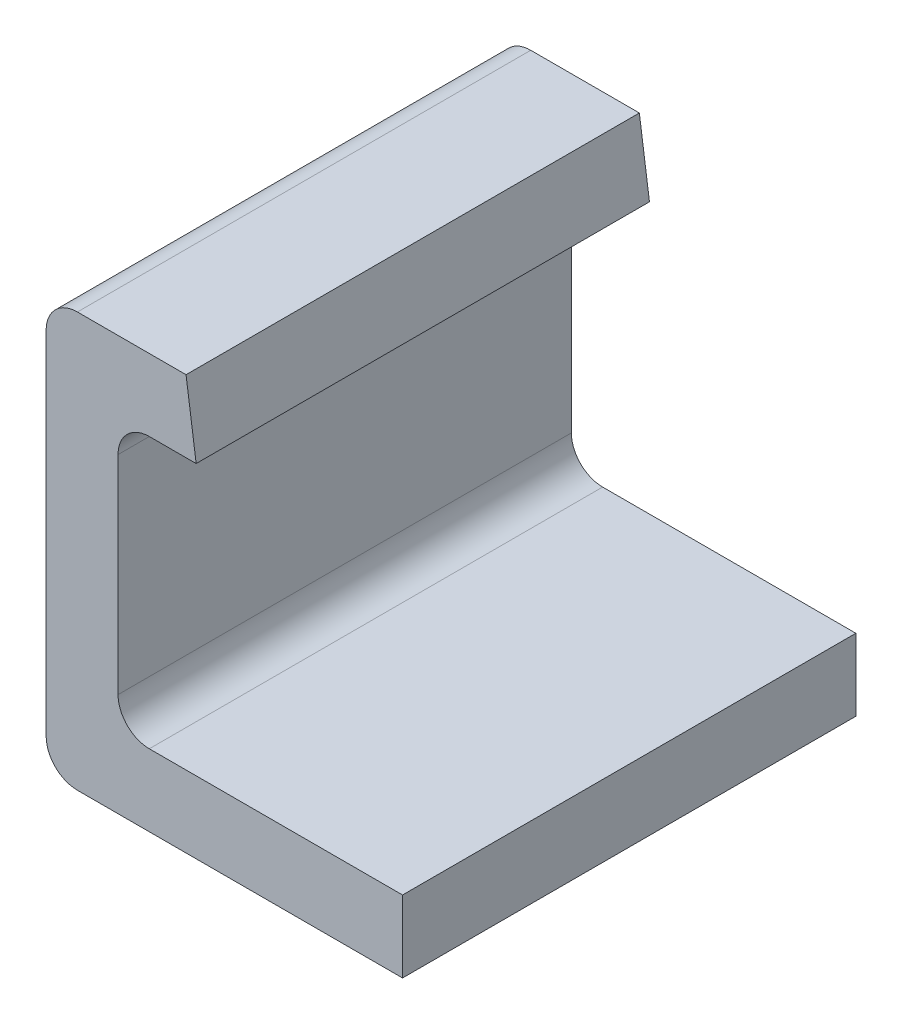
ISO-10303-21;
HEADER;
FILE_DESCRIPTION(('STEP AP214'),'2;1');
FILE_NAME('part.step','',(''),(''),'','','');
FILE_SCHEMA(('AUTOMOTIVE_DESIGN { 1 0 10303 214 1 1 1 1 }'));
ENDSEC;
DATA;
#1=APPLICATION_CONTEXT('core data for automotive mechanical design processes');
#2=APPLICATION_PROTOCOL_DEFINITION('international standard','automotive_design',2000,#1);
#3=PRODUCT_CONTEXT('',#1,'mechanical');
#4=PRODUCT('Part','Part','',(#3));
#5=PRODUCT_RELATED_PRODUCT_CATEGORY('part','',(#4));
#6=PRODUCT_DEFINITION_FORMATION('','',#4);
#7=PRODUCT_DEFINITION_CONTEXT('part definition',#1,'design');
#8=PRODUCT_DEFINITION('design','',#6,#7);
#9=PRODUCT_DEFINITION_SHAPE('','',#8);
#10=(LENGTH_UNIT() NAMED_UNIT(*) SI_UNIT(.MILLI.,.METRE.));
#11=(NAMED_UNIT(*) PLANE_ANGLE_UNIT() SI_UNIT($,.RADIAN.));
#12=(NAMED_UNIT(*) SI_UNIT($,.STERADIAN.) SOLID_ANGLE_UNIT());
#13=UNCERTAINTY_MEASURE_WITH_UNIT(LENGTH_MEASURE(1.E-05),#10,'distance_accuracy_value','');
#14=(GEOMETRIC_REPRESENTATION_CONTEXT(3) GLOBAL_UNCERTAINTY_ASSIGNED_CONTEXT((#13)) GLOBAL_UNIT_ASSIGNED_CONTEXT((#10,
#11,#12)) REPRESENTATION_CONTEXT('',''));
#15=CARTESIAN_POINT('',(0.,0.,0.));
#16=DIRECTION('',(0.,0.,1.));
#17=DIRECTION('',(1.,0.,0.));
#18=AXIS2_PLACEMENT_3D('',#15,#16,#17);
#19=CARTESIAN_POINT('',(0.10625,0.3325,0.));
#20=DIRECTION('',(0.,0.,-1.));
#21=DIRECTION('',(-1.,0.,0.));
#22=AXIS2_PLACEMENT_3D('',#19,#20,#21);
#23=CYLINDRICAL_SURFACE('',#22,0.1);
#24=DIRECTION('',(0.,0.,-1.));
#25=VECTOR('',#24,1.);
#26=CARTESIAN_POINT('',(0.00625,0.3325,0.));
#27=LINE('',#26,#25);
#28=CARTESIAN_POINT('',(0.00625,0.3325,0.));
#29=VERTEX_POINT('',#28);
#30=CARTESIAN_POINT('',(0.00625,0.3325,1.45));
#31=VERTEX_POINT('',#30);
#32=EDGE_CURVE('E96',#29,#31,#27,.F.);
#33=ORIENTED_EDGE('',*,*,#32,.F.);
#34=CARTESIAN_POINT('',(0.10625,0.3325,0.));
#35=DIRECTION('',(0.,0.,-1.));
#36=DIRECTION('',(-1.,0.,0.));
#37=AXIS2_PLACEMENT_3D('',#34,#35,#36);
#38=CIRCLE('',#37,0.1);
#39=CARTESIAN_POINT('',(0.10625,0.4325,0.));
#40=VERTEX_POINT('',#39);
#41=EDGE_CURVE('E20',#40,#29,#38,.F.);
#42=ORIENTED_EDGE('',*,*,#41,.F.);
#43=DIRECTION('',(0.,0.,-1.));
#44=VECTOR('',#43,1.);
#45=CARTESIAN_POINT('',(0.10625,0.4325,0.));
#46=LINE('',#45,#44);
#47=CARTESIAN_POINT('',(0.10625,0.4325,1.45));
#48=VERTEX_POINT('',#47);
#49=EDGE_CURVE('E120',#48,#40,#46,.T.);
#50=ORIENTED_EDGE('',*,*,#49,.F.);
#51=CARTESIAN_POINT('',(0.10625,0.3325,1.45));
#52=DIRECTION('',(0.,0.,-1.));
#53=DIRECTION('',(-1.,0.,0.));
#54=AXIS2_PLACEMENT_3D('',#51,#52,#53);
#55=CIRCLE('',#54,0.1);
#56=EDGE_CURVE('E94',#31,#48,#55,.T.);
#57=ORIENTED_EDGE('',*,*,#56,.F.);
#58=EDGE_LOOP('',(#33,#42,#50,#57));
#59=FACE_BOUND('',#58,.T.);
#60=ADVANCED_FACE('F17',(#59),#23,.F.);
#61=CARTESIAN_POINT('',(-0.22375,0.4325,0.));
#62=DIRECTION('',(0.,-1.,0.));
#63=DIRECTION('',(0.,0.,-1.));
#64=AXIS2_PLACEMENT_3D('',#61,#62,#63);
#65=PLANE('',#64);
#66=DIRECTION('',(0.,0.,1.));
#67=VECTOR('',#66,1.);
#68=CARTESIAN_POINT('',(0.25607439198153,0.432499999999934,1.45));
#69=LINE('',#68,#67);
#70=CARTESIAN_POINT('',(0.25607439198153,0.432499999999956,1.45));
#71=VERTEX_POINT('',#70);
#72=CARTESIAN_POINT('',(0.256074391981687,0.432499999999956,0.));
#73=VERTEX_POINT('',#72);
#74=EDGE_CURVE('E109',#71,#73,#69,.F.);
#75=ORIENTED_EDGE('',*,*,#74,.F.);
#76=DIRECTION('',(1.,0.,0.));
#77=VECTOR('',#76,1.);
#78=CARTESIAN_POINT('',(-0.22375,0.4325,1.45));
#79=LINE('',#78,#77);
#80=EDGE_CURVE('E100',#71,#48,#79,.F.);
#81=ORIENTED_EDGE('',*,*,#80,.T.);
#82=ORIENTED_EDGE('',*,*,#49,.T.);
#83=DIRECTION('',(1.,0.,0.));
#84=VECTOR('',#83,1.);
#85=CARTESIAN_POINT('',(-0.22375,0.4325,0.));
#86=LINE('',#85,#84);
#87=EDGE_CURVE('E92',#40,#73,#86,.T.);
#88=ORIENTED_EDGE('',*,*,#87,.T.);
#89=EDGE_LOOP('',(#75,#81,#82,#88));
#90=FACE_BOUND('',#89,.T.);
#91=ADVANCED_FACE('F155',(#90),#65,.T.);
#92=CARTESIAN_POINT('',(0.00625,-0.6625,0.));
#93=DIRECTION('',(1.,0.,0.));
#94=DIRECTION('',(0.,0.,-1.));
#95=AXIS2_PLACEMENT_3D('',#92,#93,#94);
#96=PLANE('',#95);
#97=DIRECTION('',(0.,0.,-1.));
#98=VECTOR('',#97,1.);
#99=CARTESIAN_POINT('',(0.00624999999999998,-0.3325,0.));
#100=LINE('',#99,#98);
#101=CARTESIAN_POINT('',(0.00624999999999999,-0.3325,1.45));
#102=VERTEX_POINT('',#101);
#103=CARTESIAN_POINT('',(0.00624999999999999,-0.3325,0.));
#104=VERTEX_POINT('',#103);
#105=EDGE_CURVE('E104',#102,#104,#100,.T.);
#106=ORIENTED_EDGE('',*,*,#105,.T.);
#107=DIRECTION('',(0.,1.,0.));
#108=VECTOR('',#107,1.);
#109=CARTESIAN_POINT('',(0.00625,-0.6625,0.));
#110=LINE('',#109,#108);
#111=EDGE_CURVE('E88',#104,#29,#110,.T.);
#112=ORIENTED_EDGE('',*,*,#111,.T.);
#113=ORIENTED_EDGE('',*,*,#32,.T.);
#114=DIRECTION('',(0.,1.,0.));
#115=VECTOR('',#114,1.);
#116=CARTESIAN_POINT('',(0.00625,-0.6625,1.45));
#117=LINE('',#116,#115);
#118=EDGE_CURVE('E99',#31,#102,#117,.F.);
#119=ORIENTED_EDGE('',*,*,#118,.T.);
#120=EDGE_LOOP('',(#106,#112,#113,#119));
#121=FACE_BOUND('',#120,.T.);
#122=ADVANCED_FACE('F102',(#121),#96,.T.);
#123=CARTESIAN_POINT('',(0.22375,0.6625,1.45));
#124=DIRECTION('',(0.990268068741588,0.139173100959942,0.));
#125=DIRECTION('',(-0.139173100959942,0.990268068741588,0.));
#126=AXIS2_PLACEMENT_3D('',#123,#124,#125);
#127=PLANE('',#126);
#128=DIRECTION('',(-0.139173100959942,0.990268068741588,0.));
#129=VECTOR('',#128,1.);
#130=CARTESIAN_POINT('',(0.22375,0.6625,0.));
#131=LINE('',#130,#129);
#132=CARTESIAN_POINT('',(0.22375,0.6625,0.));
#133=VERTEX_POINT('',#132);
#134=EDGE_CURVE('E116',#73,#133,#131,.T.);
#135=ORIENTED_EDGE('',*,*,#134,.T.);
#136=DIRECTION('',(0.,0.,1.));
#137=VECTOR('',#136,1.);
#138=CARTESIAN_POINT('',(0.22375,0.6625,0.));
#139=LINE('',#138,#137);
#140=CARTESIAN_POINT('',(0.22375,0.6625,1.45));
#141=VERTEX_POINT('',#140);
#142=EDGE_CURVE('E162',#141,#133,#139,.F.);
#143=ORIENTED_EDGE('',*,*,#142,.F.);
#144=DIRECTION('',(-0.139173100959942,0.990268068741588,0.));
#145=VECTOR('',#144,1.);
#146=CARTESIAN_POINT('',(0.22375,0.6625,1.45));
#147=LINE('',#146,#145);
#148=EDGE_CURVE('E106',#141,#71,#147,.F.);
#149=ORIENTED_EDGE('',*,*,#148,.T.);
#150=ORIENTED_EDGE('',*,*,#74,.T.);
#151=EDGE_LOOP('',(#135,#143,#149,#150));
#152=FACE_BOUND('',#151,.T.);
#153=ADVANCED_FACE('F160',(#152),#127,.T.);
#154=CARTESIAN_POINT('',(0.10625,-0.3325,0.));
#155=DIRECTION('',(0.,0.,-1.));
#156=DIRECTION('',(-1.,0.,0.));
#157=AXIS2_PLACEMENT_3D('',#154,#155,#156);
#158=CYLINDRICAL_SURFACE('',#157,0.1);
#159=DIRECTION('',(0.,0.,1.));
#160=VECTOR('',#159,1.);
#161=CARTESIAN_POINT('',(0.10625,-0.4325,0.));
#162=LINE('',#161,#160);
#163=CARTESIAN_POINT('',(0.10625,-0.4325,0.));
#164=VERTEX_POINT('',#163);
#165=CARTESIAN_POINT('',(0.10625,-0.4325,1.45));
#166=VERTEX_POINT('',#165);
#167=EDGE_CURVE('E200',#164,#166,#162,.T.);
#168=ORIENTED_EDGE('',*,*,#167,.F.);
#169=CARTESIAN_POINT('',(0.10625,-0.3325,0.));
#170=DIRECTION('',(0.,0.,-1.));
#171=DIRECTION('',(-1.,0.,0.));
#172=AXIS2_PLACEMENT_3D('',#169,#170,#171);
#173=CIRCLE('',#172,0.1);
#174=EDGE_CURVE('E148',#104,#164,#173,.F.);
#175=ORIENTED_EDGE('',*,*,#174,.F.);
#176=ORIENTED_EDGE('',*,*,#105,.F.);
#177=CARTESIAN_POINT('',(0.10625,-0.3325,1.45));
#178=DIRECTION('',(0.,0.,-1.));
#179=DIRECTION('',(-1.,0.,0.));
#180=AXIS2_PLACEMENT_3D('',#177,#178,#179);
#181=CIRCLE('',#180,0.1);
#182=EDGE_CURVE('E144',#166,#102,#181,.T.);
#183=ORIENTED_EDGE('',*,*,#182,.F.);
#184=EDGE_LOOP('',(#168,#175,#176,#183));
#185=FACE_BOUND('',#184,.T.);
#186=ADVANCED_FACE('F261',(#185),#158,.F.);
#187=CARTESIAN_POINT('',(0.91625,-0.6625,0.));
#188=DIRECTION('',(1.,0.,0.));
#189=DIRECTION('',(0.,0.,-1.));
#190=AXIS2_PLACEMENT_3D('',#187,#188,#189);
#191=PLANE('',#190);
#192=DIRECTION('',(0.,1.,0.));
#193=VECTOR('',#192,1.);
#194=CARTESIAN_POINT('',(0.91625,-0.6625,1.45));
#195=LINE('',#194,#193);
#196=CARTESIAN_POINT('',(0.91625,-0.4325,1.45));
#197=VERTEX_POINT('',#196);
#198=CARTESIAN_POINT('',(0.91625,-0.6625,1.45));
#199=VERTEX_POINT('',#198);
#200=EDGE_CURVE('E188',#197,#199,#195,.F.);
#201=ORIENTED_EDGE('',*,*,#200,.T.);
#202=DIRECTION('',(0.,0.,-1.));
#203=VECTOR('',#202,1.);
#204=CARTESIAN_POINT('',(0.91625,-0.6625,0.));
#205=LINE('',#204,#203);
#206=CARTESIAN_POINT('',(0.91625,-0.6625,0.));
#207=VERTEX_POINT('',#206);
#208=EDGE_CURVE('E191',#207,#199,#205,.F.);
#209=ORIENTED_EDGE('',*,*,#208,.F.);
#210=DIRECTION('',(0.,1.,0.));
#211=VECTOR('',#210,1.);
#212=CARTESIAN_POINT('',(0.91625,-0.6625,0.));
#213=LINE('',#212,#211);
#214=CARTESIAN_POINT('',(0.91625,-0.4325,0.));
#215=VERTEX_POINT('',#214);
#216=EDGE_CURVE('E147',#207,#215,#213,.T.);
#217=ORIENTED_EDGE('',*,*,#216,.T.);
#218=DIRECTION('',(0.,0.,1.));
#219=VECTOR('',#218,1.);
#220=CARTESIAN_POINT('',(0.91625,-0.4325,0.));
#221=LINE('',#220,#219);
#222=EDGE_CURVE('E193',#197,#215,#221,.F.);
#223=ORIENTED_EDGE('',*,*,#222,.F.);
#224=EDGE_LOOP('',(#201,#209,#217,#223));
#225=FACE_BOUND('',#224,.T.);
#226=ADVANCED_FACE('F190',(#225),#191,.T.);
#227=CARTESIAN_POINT('',(0.22375,0.6625,0.));
#228=DIRECTION('',(0.,1.,0.));
#229=DIRECTION('',(0.,0.,1.));
#230=AXIS2_PLACEMENT_3D('',#227,#228,#229);
#231=PLANE('',#230);
#232=ORIENTED_EDGE('',*,*,#142,.T.);
#233=DIRECTION('',(1.,0.,0.));
#234=VECTOR('',#233,1.);
#235=CARTESIAN_POINT('',(0.22375,0.6625,0.));
#236=LINE('',#235,#234);
#237=CARTESIAN_POINT('',(-0.12375,0.6625,0.));
#238=VERTEX_POINT('',#237);
#239=EDGE_CURVE('E201',#133,#238,#236,.F.);
#240=ORIENTED_EDGE('',*,*,#239,.T.);
#241=DIRECTION('',(0.,0.,1.));
#242=VECTOR('',#241,1.);
#243=CARTESIAN_POINT('',(-0.12375,0.6625,0.));
#244=LINE('',#243,#242);
#245=CARTESIAN_POINT('',(-0.12375,0.6625,1.45));
#246=VERTEX_POINT('',#245);
#247=EDGE_CURVE('E137',#246,#238,#244,.F.);
#248=ORIENTED_EDGE('',*,*,#247,.F.);
#249=DIRECTION('',(1.,0.,0.));
#250=VECTOR('',#249,1.);
#251=CARTESIAN_POINT('',(0.,0.6625,1.45));
#252=LINE('',#251,#250);
#253=EDGE_CURVE('E138',#141,#246,#252,.F.);
#254=ORIENTED_EDGE('',*,*,#253,.F.);
#255=EDGE_LOOP('',(#232,#240,#248,#254));
#256=FACE_BOUND('',#255,.T.);
#257=ADVANCED_FACE('F239',(#256),#231,.T.);
#258=CARTESIAN_POINT('',(-0.22375,-0.6625,0.));
#259=DIRECTION('',(0.,-1.,0.));
#260=DIRECTION('',(0.,0.,-1.));
#261=AXIS2_PLACEMENT_3D('',#258,#259,#260);
#262=PLANE('',#261);
#263=ORIENTED_EDGE('',*,*,#208,.T.);
#264=DIRECTION('',(1.,0.,0.));
#265=VECTOR('',#264,1.);
#266=CARTESIAN_POINT('',(0.,-0.6625,1.45));
#267=LINE('',#266,#265);
#268=CARTESIAN_POINT('',(-0.12375,-0.6625,1.45));
#269=VERTEX_POINT('',#268);
#270=EDGE_CURVE('E142',#269,#199,#267,.T.);
#271=ORIENTED_EDGE('',*,*,#270,.F.);
#272=DIRECTION('',(0.,0.,1.));
#273=VECTOR('',#272,1.);
#274=CARTESIAN_POINT('',(-0.12375,-0.6625,0.));
#275=LINE('',#274,#273);
#276=CARTESIAN_POINT('',(-0.12375,-0.6625,0.));
#277=VERTEX_POINT('',#276);
#278=EDGE_CURVE('E143',#277,#269,#275,.T.);
#279=ORIENTED_EDGE('',*,*,#278,.F.);
#280=DIRECTION('',(1.,0.,0.));
#281=VECTOR('',#280,1.);
#282=CARTESIAN_POINT('',(0.,-0.6625,0.));
#283=LINE('',#282,#281);
#284=EDGE_CURVE('E199',#277,#207,#283,.T.);
#285=ORIENTED_EDGE('',*,*,#284,.T.);
#286=EDGE_LOOP('',(#263,#271,#279,#285));
#287=FACE_BOUND('',#286,.T.);
#288=ADVANCED_FACE('F198',(#287),#262,.T.);
#289=CARTESIAN_POINT('',(0.91625,-0.4325,0.));
#290=DIRECTION('',(0.,1.,0.));
#291=DIRECTION('',(0.,0.,1.));
#292=AXIS2_PLACEMENT_3D('',#289,#290,#291);
#293=PLANE('',#292);
#294=ORIENTED_EDGE('',*,*,#222,.T.);
#295=DIRECTION('',(1.,0.,0.));
#296=VECTOR('',#295,1.);
#297=CARTESIAN_POINT('',(0.,-0.4325,0.));
#298=LINE('',#297,#296);
#299=EDGE_CURVE('E133',#215,#164,#298,.F.);
#300=ORIENTED_EDGE('',*,*,#299,.T.);
#301=ORIENTED_EDGE('',*,*,#167,.T.);
#302=DIRECTION('',(1.,0.,0.));
#303=VECTOR('',#302,1.);
#304=CARTESIAN_POINT('',(0.,-0.4325,1.45));
#305=LINE('',#304,#303);
#306=EDGE_CURVE('E204',#197,#166,#305,.F.);
#307=ORIENTED_EDGE('',*,*,#306,.F.);
#308=EDGE_LOOP('',(#294,#300,#301,#307));
#309=FACE_BOUND('',#308,.T.);
#310=ADVANCED_FACE('F258',(#309),#293,.T.);
#311=CARTESIAN_POINT('',(-0.12375,-0.5625,0.));
#312=DIRECTION('',(0.,0.,1.));
#313=DIRECTION('',(1.,0.,0.));
#314=AXIS2_PLACEMENT_3D('',#311,#312,#313);
#315=CYLINDRICAL_SURFACE('',#314,0.1);
#316=CARTESIAN_POINT('',(-0.12375,-0.5625,0.));
#317=DIRECTION('',(0.,0.,1.));
#318=DIRECTION('',(1.,0.,0.));
#319=AXIS2_PLACEMENT_3D('',#316,#317,#318);
#320=CIRCLE('',#319,0.1);
#321=CARTESIAN_POINT('',(-0.22375,-0.5625,0.));
#322=VERTEX_POINT('',#321);
#323=EDGE_CURVE('E128',#322,#277,#320,.T.);
#324=ORIENTED_EDGE('',*,*,#323,.T.);
#325=ORIENTED_EDGE('',*,*,#278,.T.);
#326=CARTESIAN_POINT('',(-0.12375,-0.5625,1.45));
#327=DIRECTION('',(0.,0.,1.));
#328=DIRECTION('',(1.,0.,0.));
#329=AXIS2_PLACEMENT_3D('',#326,#327,#328);
#330=CIRCLE('',#329,0.1);
#331=CARTESIAN_POINT('',(-0.22375,-0.5625,1.45));
#332=VERTEX_POINT('',#331);
#333=EDGE_CURVE('E139',#332,#269,#330,.T.);
#334=ORIENTED_EDGE('',*,*,#333,.F.);
#335=DIRECTION('',(0.,0.,1.));
#336=VECTOR('',#335,1.);
#337=CARTESIAN_POINT('',(-0.22375,-0.5625,0.));
#338=LINE('',#337,#336);
#339=EDGE_CURVE('E131',#322,#332,#338,.T.);
#340=ORIENTED_EDGE('',*,*,#339,.F.);
#341=EDGE_LOOP('',(#324,#325,#334,#340));
#342=FACE_BOUND('',#341,.T.);
#343=ADVANCED_FACE('F285',(#342),#315,.T.);
#344=CARTESIAN_POINT('',(0.,0.5475,1.45));
#345=DIRECTION('',(0.,0.,1.));
#346=DIRECTION('',(1.,0.,0.));
#347=AXIS2_PLACEMENT_3D('',#344,#345,#346);
#348=PLANE('',#347);
#349=CARTESIAN_POINT('',(-0.12375,0.5625,1.45));
#350=DIRECTION('',(0.,0.,1.));
#351=DIRECTION('',(1.,0.,0.));
#352=AXIS2_PLACEMENT_3D('',#349,#350,#351);
#353=CIRCLE('',#352,0.1);
#354=CARTESIAN_POINT('',(-0.22375,0.5625,1.45));
#355=VERTEX_POINT('',#354);
#356=EDGE_CURVE('E134',#355,#246,#353,.F.);
#357=ORIENTED_EDGE('',*,*,#356,.F.);
#358=DIRECTION('',(0.,-1.,0.));
#359=VECTOR('',#358,1.);
#360=CARTESIAN_POINT('',(-0.22375,0.6625,1.45));
#361=LINE('',#360,#359);
#362=EDGE_CURVE('E243',#332,#355,#361,.F.);
#363=ORIENTED_EDGE('',*,*,#362,.F.);
#364=ORIENTED_EDGE('',*,*,#333,.T.);
#365=ORIENTED_EDGE('',*,*,#270,.T.);
#366=ORIENTED_EDGE('',*,*,#200,.F.);
#367=ORIENTED_EDGE('',*,*,#306,.T.);
#368=ORIENTED_EDGE('',*,*,#182,.T.);
#369=ORIENTED_EDGE('',*,*,#118,.F.);
#370=ORIENTED_EDGE('',*,*,#56,.T.);
#371=ORIENTED_EDGE('',*,*,#80,.F.);
#372=ORIENTED_EDGE('',*,*,#148,.F.);
#373=ORIENTED_EDGE('',*,*,#253,.T.);
#374=EDGE_LOOP('',(#357,#363,#364,#365,#366,#367,#368,#369,#370,#371,#372,#373));
#375=FACE_BOUND('',#374,.T.);
#376=ADVANCED_FACE('F151',(#375),#348,.T.);
#377=CARTESIAN_POINT('',(-0.12375,0.5625,0.));
#378=DIRECTION('',(0.,0.,1.));
#379=DIRECTION('',(1.,0.,0.));
#380=AXIS2_PLACEMENT_3D('',#377,#378,#379);
#381=CYLINDRICAL_SURFACE('',#380,0.1);
#382=CARTESIAN_POINT('',(-0.12375,0.5625,0.));
#383=DIRECTION('',(0.,0.,1.));
#384=DIRECTION('',(1.,0.,0.));
#385=AXIS2_PLACEMENT_3D('',#382,#383,#384);
#386=CIRCLE('',#385,0.1);
#387=CARTESIAN_POINT('',(-0.22375,0.5625,0.));
#388=VERTEX_POINT('',#387);
#389=EDGE_CURVE('E35',#238,#388,#386,.T.);
#390=ORIENTED_EDGE('',*,*,#389,.T.);
#391=DIRECTION('',(0.,0.,1.));
#392=VECTOR('',#391,1.);
#393=CARTESIAN_POINT('',(-0.22375,0.5625,0.));
#394=LINE('',#393,#392);
#395=EDGE_CURVE('E26',#355,#388,#394,.F.);
#396=ORIENTED_EDGE('',*,*,#395,.F.);
#397=ORIENTED_EDGE('',*,*,#356,.T.);
#398=ORIENTED_EDGE('',*,*,#247,.T.);
#399=EDGE_LOOP('',(#390,#396,#397,#398));
#400=FACE_BOUND('',#399,.T.);
#401=ADVANCED_FACE('F278',(#400),#381,.T.);
#402=CARTESIAN_POINT('',(0.,0.5475,0.));
#403=DIRECTION('',(0.,0.,1.));
#404=DIRECTION('',(1.,0.,0.));
#405=AXIS2_PLACEMENT_3D('',#402,#403,#404);
#406=PLANE('',#405);
#407=DIRECTION('',(0.,-1.,0.));
#408=VECTOR('',#407,1.);
#409=CARTESIAN_POINT('',(-0.22375,0.6625,0.));
#410=LINE('',#409,#408);
#411=EDGE_CURVE('E11',#388,#322,#410,.T.);
#412=ORIENTED_EDGE('',*,*,#411,.F.);
#413=ORIENTED_EDGE('',*,*,#389,.F.);
#414=ORIENTED_EDGE('',*,*,#239,.F.);
#415=ORIENTED_EDGE('',*,*,#134,.F.);
#416=ORIENTED_EDGE('',*,*,#87,.F.);
#417=ORIENTED_EDGE('',*,*,#41,.T.);
#418=ORIENTED_EDGE('',*,*,#111,.F.);
#419=ORIENTED_EDGE('',*,*,#174,.T.);
#420=ORIENTED_EDGE('',*,*,#299,.F.);
#421=ORIENTED_EDGE('',*,*,#216,.F.);
#422=ORIENTED_EDGE('',*,*,#284,.F.);
#423=ORIENTED_EDGE('',*,*,#323,.F.);
#424=EDGE_LOOP('',(#412,#413,#414,#415,#416,#417,#418,#419,#420,#421,#422,#423));
#425=FACE_BOUND('',#424,.T.);
#426=ADVANCED_FACE('F86',(#425),#406,.F.);
#427=CARTESIAN_POINT('',(-0.22375,0.6625,0.));
#428=DIRECTION('',(-1.,0.,0.));
#429=DIRECTION('',(0.,-1.,0.));
#430=AXIS2_PLACEMENT_3D('',#427,#428,#429);
#431=PLANE('',#430);
#432=ORIENTED_EDGE('',*,*,#395,.T.);
#433=ORIENTED_EDGE('',*,*,#411,.T.);
#434=ORIENTED_EDGE('',*,*,#339,.T.);
#435=ORIENTED_EDGE('',*,*,#362,.T.);
#436=EDGE_LOOP('',(#432,#433,#434,#435));
#437=FACE_BOUND('',#436,.T.);
#438=ADVANCED_FACE('F271',(#437),#431,.T.);
#439=CLOSED_SHELL('',(#60,#91,#122,#153,#186,#226,#257,#288,#310,#343,#376,#401,#426,#438));
#440=MANIFOLD_SOLID_BREP('B1',#439);
#441=ADVANCED_BREP_SHAPE_REPRESENTATION('',(#18,#440),#14);
#442=SHAPE_DEFINITION_REPRESENTATION(#9,#441);
ENDSEC;
END-ISO-10303-21;
